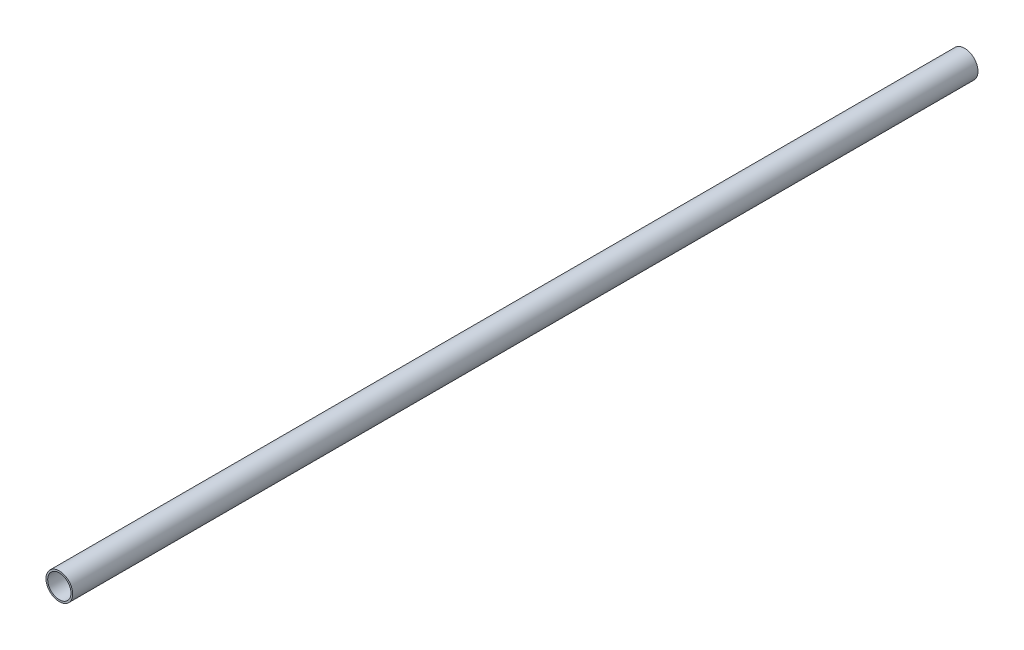
ISO-10303-21;
HEADER;
FILE_DESCRIPTION(('STEP AP214'),'2;1');
FILE_NAME('part.step','',(''),(''),'','','');
FILE_SCHEMA(('AUTOMOTIVE_DESIGN { 1 0 10303 214 1 1 1 1 }'));
ENDSEC;
DATA;
#1=APPLICATION_CONTEXT('core data for automotive mechanical design processes');
#2=APPLICATION_PROTOCOL_DEFINITION('international standard','automotive_design',2000,#1);
#3=PRODUCT_CONTEXT('',#1,'mechanical');
#4=PRODUCT('Part','Part','',(#3));
#5=PRODUCT_RELATED_PRODUCT_CATEGORY('part','',(#4));
#6=PRODUCT_DEFINITION_FORMATION('','',#4);
#7=PRODUCT_DEFINITION_CONTEXT('part definition',#1,'design');
#8=PRODUCT_DEFINITION('design','',#6,#7);
#9=PRODUCT_DEFINITION_SHAPE('','',#8);
#10=(LENGTH_UNIT() NAMED_UNIT(*) SI_UNIT(.MILLI.,.METRE.));
#11=(NAMED_UNIT(*) PLANE_ANGLE_UNIT() SI_UNIT($,.RADIAN.));
#12=(NAMED_UNIT(*) SI_UNIT($,.STERADIAN.) SOLID_ANGLE_UNIT());
#13=UNCERTAINTY_MEASURE_WITH_UNIT(LENGTH_MEASURE(1.E-05),#10,'distance_accuracy_value','');
#14=(GEOMETRIC_REPRESENTATION_CONTEXT(3) GLOBAL_UNCERTAINTY_ASSIGNED_CONTEXT((#13)) GLOBAL_UNIT_ASSIGNED_CONTEXT((#10,
#11,#12)) REPRESENTATION_CONTEXT('',''));
#15=CARTESIAN_POINT('',(0.,0.,0.));
#16=DIRECTION('',(0.,0.,1.));
#17=DIRECTION('',(1.,0.,0.));
#18=AXIS2_PLACEMENT_3D('',#15,#16,#17);
#19=CARTESIAN_POINT('',(410.,40.45,262.5));
#20=DIRECTION('',(0.,0.,-1.));
#21=DIRECTION('',(-1.,0.,0.));
#22=AXIS2_PLACEMENT_3D('',#19,#20,#21);
#23=CYLINDRICAL_SURFACE('',#22,7.74999999999997);
#24=CARTESIAN_POINT('',(410.,40.45,262.5));
#25=DIRECTION('',(0.,0.,1.));
#26=DIRECTION('',(1.,0.,0.));
#27=AXIS2_PLACEMENT_3D('',#24,#25,#26);
#28=CIRCLE('',#27,7.74999999999997);
#29=CARTESIAN_POINT('',(417.75,40.45,262.5));
#30=VERTEX_POINT('',#29);
#31=EDGE_CURVE('E10',#30,#30,#28,.T.);
#32=ORIENTED_EDGE('',*,*,#31,.F.);
#33=EDGE_LOOP('',(#32));
#34=FACE_BOUND('',#33,.T.);
#35=CARTESIAN_POINT('',(410.,40.45,-262.5));
#36=DIRECTION('',(0.,0.,1.));
#37=DIRECTION('',(1.,0.,0.));
#38=AXIS2_PLACEMENT_3D('',#35,#36,#37);
#39=CIRCLE('',#38,7.74999999999997);
#40=CARTESIAN_POINT('',(417.75,40.45,-262.5));
#41=VERTEX_POINT('',#40);
#42=EDGE_CURVE('E38',#41,#41,#39,.T.);
#43=ORIENTED_EDGE('',*,*,#42,.T.);
#44=EDGE_LOOP('',(#43));
#45=FACE_BOUND('',#44,.T.);
#46=ADVANCED_FACE('F31',(#34,#45),#23,.T.);
#47=CARTESIAN_POINT('',(410.,40.45,262.5));
#48=DIRECTION('',(0.,0.,1.));
#49=DIRECTION('',(1.,0.,0.));
#50=AXIS2_PLACEMENT_3D('',#47,#48,#49);
#51=PLANE('',#50);
#52=CARTESIAN_POINT('',(410.,40.45,262.5));
#53=DIRECTION('',(0.,0.,1.));
#54=DIRECTION('',(1.,0.,0.));
#55=AXIS2_PLACEMENT_3D('',#52,#53,#54);
#56=CIRCLE('',#55,6.74999999999998);
#57=CARTESIAN_POINT('',(416.75,40.45,262.5));
#58=VERTEX_POINT('',#57);
#59=EDGE_CURVE('E43',#58,#58,#56,.T.);
#60=ORIENTED_EDGE('',*,*,#59,.F.);
#61=EDGE_LOOP('',(#60));
#62=FACE_BOUND('',#61,.T.);
#63=ORIENTED_EDGE('',*,*,#31,.T.);
#64=EDGE_LOOP('',(#63));
#65=FACE_BOUND('',#64,.T.);
#66=ADVANCED_FACE('F60',(#62,#65),#51,.T.);
#67=CARTESIAN_POINT('',(410.,40.45,-262.5));
#68=DIRECTION('',(0.,0.,1.));
#69=DIRECTION('',(1.,0.,0.));
#70=AXIS2_PLACEMENT_3D('',#67,#68,#69);
#71=PLANE('',#70);
#72=CARTESIAN_POINT('',(410.,40.45,-262.5));
#73=DIRECTION('',(0.,0.,1.));
#74=DIRECTION('',(1.,0.,0.));
#75=AXIS2_PLACEMENT_3D('',#72,#73,#74);
#76=CIRCLE('',#75,6.74999999999998);
#77=CARTESIAN_POINT('',(416.75,40.45,-262.5));
#78=VERTEX_POINT('',#77);
#79=EDGE_CURVE('E34',#78,#78,#76,.T.);
#80=ORIENTED_EDGE('',*,*,#79,.T.);
#81=EDGE_LOOP('',(#80));
#82=FACE_BOUND('',#81,.T.);
#83=ORIENTED_EDGE('',*,*,#42,.F.);
#84=EDGE_LOOP('',(#83));
#85=FACE_BOUND('',#84,.T.);
#86=ADVANCED_FACE('F51',(#82,#85),#71,.F.);
#87=CARTESIAN_POINT('',(410.,40.45,-284.7));
#88=DIRECTION('',(0.,0.,1.));
#89=DIRECTION('',(1.,0.,0.));
#90=AXIS2_PLACEMENT_3D('',#87,#88,#89);
#91=CYLINDRICAL_SURFACE('',#90,6.74999999999998);
#92=ORIENTED_EDGE('',*,*,#59,.T.);
#93=EDGE_LOOP('',(#92));
#94=FACE_BOUND('',#93,.T.);
#95=ORIENTED_EDGE('',*,*,#79,.F.);
#96=EDGE_LOOP('',(#95));
#97=FACE_BOUND('',#96,.T.);
#98=ADVANCED_FACE('F54',(#94,#97),#91,.F.);
#99=CLOSED_SHELL('',(#46,#66,#86,#98));
#100=MANIFOLD_SOLID_BREP('B2',#99);
#101=ADVANCED_BREP_SHAPE_REPRESENTATION('',(#18,#100),#14);
#102=SHAPE_DEFINITION_REPRESENTATION(#9,#101);
ENDSEC;
END-ISO-10303-21;
